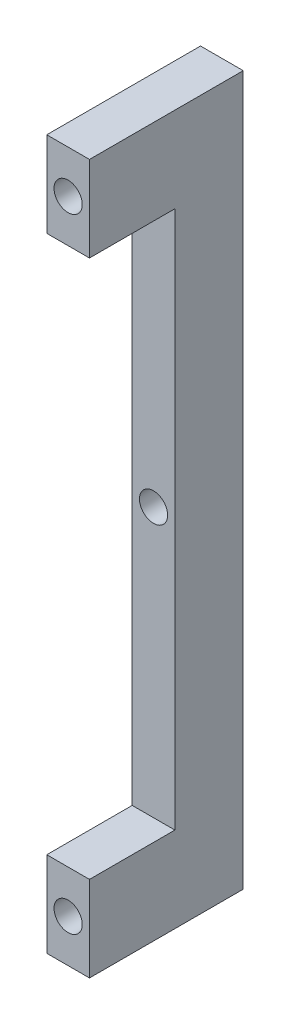
ISO-10303-21;
HEADER;
FILE_DESCRIPTION(('STEP AP214'),'2;1');
FILE_NAME('part.step','',(''),(''),'','','');
FILE_SCHEMA(('AUTOMOTIVE_DESIGN { 1 0 10303 214 1 1 1 1 }'));
ENDSEC;
DATA;
#1=APPLICATION_CONTEXT('core data for automotive mechanical design processes');
#2=APPLICATION_PROTOCOL_DEFINITION('international standard','automotive_design',2000,#1);
#3=PRODUCT_CONTEXT('',#1,'mechanical');
#4=PRODUCT('Part','Part','',(#3));
#5=PRODUCT_RELATED_PRODUCT_CATEGORY('part','',(#4));
#6=PRODUCT_DEFINITION_FORMATION('','',#4);
#7=PRODUCT_DEFINITION_CONTEXT('part definition',#1,'design');
#8=PRODUCT_DEFINITION('design','',#6,#7);
#9=PRODUCT_DEFINITION_SHAPE('','',#8);
#10=(LENGTH_UNIT() NAMED_UNIT(*) SI_UNIT(.MILLI.,.METRE.));
#11=(NAMED_UNIT(*) PLANE_ANGLE_UNIT() SI_UNIT($,.RADIAN.));
#12=(NAMED_UNIT(*) SI_UNIT($,.STERADIAN.) SOLID_ANGLE_UNIT());
#13=UNCERTAINTY_MEASURE_WITH_UNIT(LENGTH_MEASURE(1.E-05),#10,'distance_accuracy_value','');
#14=(GEOMETRIC_REPRESENTATION_CONTEXT(3) GLOBAL_UNCERTAINTY_ASSIGNED_CONTEXT((#13)) GLOBAL_UNIT_ASSIGNED_CONTEXT((#10,
#11,#12)) REPRESENTATION_CONTEXT('',''));
#15=CARTESIAN_POINT('',(0.,0.,0.));
#16=DIRECTION('',(0.,0.,1.));
#17=DIRECTION('',(1.,0.,0.));
#18=AXIS2_PLACEMENT_3D('',#15,#16,#17);
#19=CARTESIAN_POINT('',(0.,0.,0.));
#20=DIRECTION('',(0.,0.,1.));
#21=DIRECTION('',(1.,0.,0.));
#22=AXIS2_PLACEMENT_3D('',#19,#20,#21);
#23=PLANE('',#22);
#24=DIRECTION('',(-1.,0.,0.));
#25=VECTOR('',#24,1.);
#26=CARTESIAN_POINT('',(-2.5,68.,0.));
#27=LINE('',#26,#25);
#28=CARTESIAN_POINT('',(2.50000000000001,68.,0.));
#29=VERTEX_POINT('',#28);
#30=CARTESIAN_POINT('',(-2.5,68.,0.));
#31=VERTEX_POINT('',#30);
#32=EDGE_CURVE('E139',#29,#31,#27,.T.);
#33=ORIENTED_EDGE('',*,*,#32,.F.);
#34=DIRECTION('',(0.,1.,0.));
#35=VECTOR('',#34,1.);
#36=CARTESIAN_POINT('',(2.5,78.,0.));
#37=LINE('',#36,#35);
#38=CARTESIAN_POINT('',(2.5,78.,0.));
#39=VERTEX_POINT('',#38);
#40=EDGE_CURVE('E180',#29,#39,#37,.T.);
#41=ORIENTED_EDGE('',*,*,#40,.T.);
#42=DIRECTION('',(-1.,0.,0.));
#43=VECTOR('',#42,1.);
#44=CARTESIAN_POINT('',(-2.5,78.,0.));
#45=LINE('',#44,#43);
#46=CARTESIAN_POINT('',(-2.5,78.,0.));
#47=VERTEX_POINT('',#46);
#48=EDGE_CURVE('E167',#39,#47,#45,.T.);
#49=ORIENTED_EDGE('',*,*,#48,.T.);
#50=DIRECTION('',(0.,-1.,0.));
#51=VECTOR('',#50,1.);
#52=CARTESIAN_POINT('',(-2.5,78.,0.));
#53=LINE('',#52,#51);
#54=EDGE_CURVE('E174',#47,#31,#53,.T.);
#55=ORIENTED_EDGE('',*,*,#54,.T.);
#56=EDGE_LOOP('',(#33,#41,#49,#55));
#57=FACE_BOUND('',#56,.T.);
#58=CARTESIAN_POINT('',(0.,73.,0.));
#59=DIRECTION('',(0.,0.,1.));
#60=DIRECTION('',(1.,0.,0.));
#61=AXIS2_PLACEMENT_3D('',#58,#59,#60);
#62=CIRCLE('',#61,1.65);
#63=CARTESIAN_POINT('',(1.65,73.,0.));
#64=VERTEX_POINT('',#63);
#65=EDGE_CURVE('E158',#64,#64,#62,.T.);
#66=ORIENTED_EDGE('',*,*,#65,.F.);
#67=EDGE_LOOP('',(#66));
#68=FACE_BOUND('',#67,.T.);
#69=ADVANCED_FACE('F49',(#57,#68),#23,.T.);
#70=CARTESIAN_POINT('',(0.,36.5,0.));
#71=DIRECTION('',(0.,0.,1.));
#72=DIRECTION('',(1.,0.,0.));
#73=AXIS2_PLACEMENT_3D('',#70,#71,#72);
#74=CYLINDRICAL_SURFACE('',#73,1.65);
#75=CARTESIAN_POINT('',(0.,36.5,-18.));
#76=DIRECTION('',(0.,0.,1.));
#77=DIRECTION('',(1.,0.,0.));
#78=AXIS2_PLACEMENT_3D('',#75,#76,#77);
#79=CIRCLE('',#78,1.65);
#80=CARTESIAN_POINT('',(1.65,36.5,-18.));
#81=VERTEX_POINT('',#80);
#82=EDGE_CURVE('E155',#81,#81,#79,.T.);
#83=ORIENTED_EDGE('',*,*,#82,.F.);
#84=EDGE_LOOP('',(#83));
#85=FACE_BOUND('',#84,.T.);
#86=CARTESIAN_POINT('',(0.,36.5,-10.));
#87=DIRECTION('',(0.,0.,1.));
#88=DIRECTION('',(1.,0.,0.));
#89=AXIS2_PLACEMENT_3D('',#86,#87,#88);
#90=CIRCLE('',#89,1.65);
#91=CARTESIAN_POINT('',(1.65,36.5,-10.));
#92=VERTEX_POINT('',#91);
#93=EDGE_CURVE('E53',#92,#92,#90,.F.);
#94=ORIENTED_EDGE('',*,*,#93,.F.);
#95=EDGE_LOOP('',(#94));
#96=FACE_BOUND('',#95,.T.);
#97=ADVANCED_FACE('F219',(#85,#96),#74,.F.);
#98=CARTESIAN_POINT('',(-2.5,78.,-18.));
#99=DIRECTION('',(-1.,0.,0.));
#100=DIRECTION('',(0.,-1.,0.));
#101=AXIS2_PLACEMENT_3D('',#98,#99,#100);
#102=PLANE('',#101);
#103=DIRECTION('',(0.,0.,1.));
#104=VECTOR('',#103,1.);
#105=CARTESIAN_POINT('',(-2.5,68.,-10.));
#106=LINE('',#105,#104);
#107=CARTESIAN_POINT('',(-2.5,68.,-10.));
#108=VERTEX_POINT('',#107);
#109=EDGE_CURVE('E199',#108,#31,#106,.T.);
#110=ORIENTED_EDGE('',*,*,#109,.T.);
#111=ORIENTED_EDGE('',*,*,#54,.F.);
#112=DIRECTION('',(0.,0.,1.));
#113=VECTOR('',#112,1.);
#114=CARTESIAN_POINT('',(-2.5,78.,-18.));
#115=LINE('',#114,#113);
#116=CARTESIAN_POINT('',(-2.5,78.,-18.));
#117=VERTEX_POINT('',#116);
#118=EDGE_CURVE('E13',#117,#47,#115,.T.);
#119=ORIENTED_EDGE('',*,*,#118,.F.);
#120=DIRECTION('',(0.,-1.,0.));
#121=VECTOR('',#120,1.);
#122=CARTESIAN_POINT('',(-2.5,78.,-18.));
#123=LINE('',#122,#121);
#124=CARTESIAN_POINT('',(-2.49999999999999,-5.,-18.));
#125=VERTEX_POINT('',#124);
#126=EDGE_CURVE('E164',#117,#125,#123,.T.);
#127=ORIENTED_EDGE('',*,*,#126,.T.);
#128=DIRECTION('',(0.,0.,1.));
#129=VECTOR('',#128,1.);
#130=CARTESIAN_POINT('',(-2.49999999999999,-5.,-18.));
#131=LINE('',#130,#129);
#132=CARTESIAN_POINT('',(-2.49999999999999,-5.,0.));
#133=VERTEX_POINT('',#132);
#134=EDGE_CURVE('E100',#125,#133,#131,.T.);
#135=ORIENTED_EDGE('',*,*,#134,.T.);
#136=CARTESIAN_POINT('',(-2.49999999999999,5.00000000000003,0.));
#137=VERTEX_POINT('',#136);
#138=EDGE_CURVE('E142',#137,#133,#53,.T.);
#139=ORIENTED_EDGE('',*,*,#138,.F.);
#140=DIRECTION('',(0.,0.,1.));
#141=VECTOR('',#140,1.);
#142=CARTESIAN_POINT('',(-2.5,5.,-10.));
#143=LINE('',#142,#141);
#144=CARTESIAN_POINT('',(-2.5,5.,-10.));
#145=VERTEX_POINT('',#144);
#146=EDGE_CURVE('E66',#145,#137,#143,.T.);
#147=ORIENTED_EDGE('',*,*,#146,.F.);
#148=DIRECTION('',(0.,-1.,0.));
#149=VECTOR('',#148,1.);
#150=CARTESIAN_POINT('',(-2.5,68.,-10.));
#151=LINE('',#150,#149);
#152=EDGE_CURVE('E130',#108,#145,#151,.T.);
#153=ORIENTED_EDGE('',*,*,#152,.F.);
#154=EDGE_LOOP('',(#110,#111,#119,#127,#135,#139,#147,#153));
#155=FACE_BOUND('',#154,.T.);
#156=ADVANCED_FACE('F51',(#155),#102,.T.);
#157=CARTESIAN_POINT('',(-2.5,78.,-18.));
#158=DIRECTION('',(0.,1.,0.));
#159=DIRECTION('',(0.,0.,1.));
#160=AXIS2_PLACEMENT_3D('',#157,#158,#159);
#161=PLANE('',#160);
#162=ORIENTED_EDGE('',*,*,#48,.F.);
#163=DIRECTION('',(0.,0.,1.));
#164=VECTOR('',#163,1.);
#165=CARTESIAN_POINT('',(2.5,78.,-18.));
#166=LINE('',#165,#164);
#167=CARTESIAN_POINT('',(2.5,78.,-18.));
#168=VERTEX_POINT('',#167);
#169=EDGE_CURVE('E58',#168,#39,#166,.T.);
#170=ORIENTED_EDGE('',*,*,#169,.F.);
#171=DIRECTION('',(-1.,0.,0.));
#172=VECTOR('',#171,1.);
#173=CARTESIAN_POINT('',(-2.5,78.,-18.));
#174=LINE('',#173,#172);
#175=EDGE_CURVE('E172',#168,#117,#174,.T.);
#176=ORIENTED_EDGE('',*,*,#175,.T.);
#177=ORIENTED_EDGE('',*,*,#118,.T.);
#178=EDGE_LOOP('',(#162,#170,#176,#177));
#179=FACE_BOUND('',#178,.T.);
#180=ADVANCED_FACE('F211',(#179),#161,.T.);
#181=CARTESIAN_POINT('',(2.5,78.,-18.));
#182=DIRECTION('',(1.,0.,0.));
#183=DIRECTION('',(0.,1.,0.));
#184=AXIS2_PLACEMENT_3D('',#181,#182,#183);
#185=PLANE('',#184);
#186=DIRECTION('',(0.,0.,1.));
#187=VECTOR('',#186,1.);
#188=CARTESIAN_POINT('',(2.50000000000001,68.,-10.));
#189=LINE('',#188,#187);
#190=CARTESIAN_POINT('',(2.50000000000001,68.,-10.));
#191=VERTEX_POINT('',#190);
#192=EDGE_CURVE('E144',#191,#29,#189,.T.);
#193=ORIENTED_EDGE('',*,*,#192,.F.);
#194=DIRECTION('',(0.,1.,0.));
#195=VECTOR('',#194,1.);
#196=CARTESIAN_POINT('',(2.50000000000001,68.,-10.));
#197=LINE('',#196,#195);
#198=CARTESIAN_POINT('',(2.50000000000001,5.,-10.));
#199=VERTEX_POINT('',#198);
#200=EDGE_CURVE('E129',#199,#191,#197,.T.);
#201=ORIENTED_EDGE('',*,*,#200,.F.);
#202=DIRECTION('',(0.,0.,1.));
#203=VECTOR('',#202,1.);
#204=CARTESIAN_POINT('',(2.50000000000001,5.,-10.));
#205=LINE('',#204,#203);
#206=CARTESIAN_POINT('',(2.50000000000001,5.,0.));
#207=VERTEX_POINT('',#206);
#208=EDGE_CURVE('E126',#199,#207,#205,.T.);
#209=ORIENTED_EDGE('',*,*,#208,.T.);
#210=CARTESIAN_POINT('',(2.50000000000001,-5.,0.));
#211=VERTEX_POINT('',#210);
#212=EDGE_CURVE('E181',#211,#207,#37,.T.);
#213=ORIENTED_EDGE('',*,*,#212,.F.);
#214=DIRECTION('',(0.,0.,1.));
#215=VECTOR('',#214,1.);
#216=CARTESIAN_POINT('',(2.50000000000001,-5.,-18.));
#217=LINE('',#216,#215);
#218=CARTESIAN_POINT('',(2.50000000000001,-5.,-18.));
#219=VERTEX_POINT('',#218);
#220=EDGE_CURVE('E188',#219,#211,#217,.T.);
#221=ORIENTED_EDGE('',*,*,#220,.F.);
#222=DIRECTION('',(0.,1.,0.));
#223=VECTOR('',#222,1.);
#224=CARTESIAN_POINT('',(2.5,78.,-18.));
#225=LINE('',#224,#223);
#226=EDGE_CURVE('E169',#219,#168,#225,.T.);
#227=ORIENTED_EDGE('',*,*,#226,.T.);
#228=ORIENTED_EDGE('',*,*,#169,.T.);
#229=ORIENTED_EDGE('',*,*,#40,.F.);
#230=EDGE_LOOP('',(#193,#201,#209,#213,#221,#227,#228,#229));
#231=FACE_BOUND('',#230,.T.);
#232=ADVANCED_FACE('F208',(#231),#185,.T.);
#233=CARTESIAN_POINT('',(-2.49999999999999,-5.,-18.));
#234=DIRECTION('',(0.,-1.,0.));
#235=DIRECTION('',(0.,0.,-1.));
#236=AXIS2_PLACEMENT_3D('',#233,#234,#235);
#237=PLANE('',#236);
#238=DIRECTION('',(1.,0.,0.));
#239=VECTOR('',#238,1.);
#240=CARTESIAN_POINT('',(-2.49999999999999,-5.,0.));
#241=LINE('',#240,#239);
#242=EDGE_CURVE('E177',#133,#211,#241,.T.);
#243=ORIENTED_EDGE('',*,*,#242,.F.);
#244=ORIENTED_EDGE('',*,*,#134,.F.);
#245=DIRECTION('',(1.,0.,0.));
#246=VECTOR('',#245,1.);
#247=CARTESIAN_POINT('',(-2.49999999999999,-5.,-18.));
#248=LINE('',#247,#246);
#249=EDGE_CURVE('E166',#125,#219,#248,.T.);
#250=ORIENTED_EDGE('',*,*,#249,.T.);
#251=ORIENTED_EDGE('',*,*,#220,.T.);
#252=EDGE_LOOP('',(#243,#244,#250,#251));
#253=FACE_BOUND('',#252,.T.);
#254=ADVANCED_FACE('F189',(#253),#237,.T.);
#255=CARTESIAN_POINT('',(0.,0.,-18.));
#256=DIRECTION('',(0.,0.,1.));
#257=DIRECTION('',(1.,0.,0.));
#258=AXIS2_PLACEMENT_3D('',#255,#256,#257);
#259=PLANE('',#258);
#260=CARTESIAN_POINT('',(0.,0.,-18.));
#261=DIRECTION('',(0.,0.,1.));
#262=DIRECTION('',(1.,0.,0.));
#263=AXIS2_PLACEMENT_3D('',#260,#261,#262);
#264=CIRCLE('',#263,1.65);
#265=CARTESIAN_POINT('',(1.65,0.,-18.));
#266=VERTEX_POINT('',#265);
#267=EDGE_CURVE('E152',#266,#266,#264,.T.);
#268=ORIENTED_EDGE('',*,*,#267,.T.);
#269=EDGE_LOOP('',(#268));
#270=FACE_BOUND('',#269,.T.);
#271=ORIENTED_EDGE('',*,*,#82,.T.);
#272=EDGE_LOOP('',(#271));
#273=FACE_BOUND('',#272,.T.);
#274=CARTESIAN_POINT('',(0.,73.,-18.));
#275=DIRECTION('',(0.,0.,1.));
#276=DIRECTION('',(1.,0.,0.));
#277=AXIS2_PLACEMENT_3D('',#274,#275,#276);
#278=CIRCLE('',#277,1.65);
#279=CARTESIAN_POINT('',(1.65,73.,-18.));
#280=VERTEX_POINT('',#279);
#281=EDGE_CURVE('E161',#280,#280,#278,.T.);
#282=ORIENTED_EDGE('',*,*,#281,.T.);
#283=EDGE_LOOP('',(#282));
#284=FACE_BOUND('',#283,.T.);
#285=ORIENTED_EDGE('',*,*,#126,.F.);
#286=ORIENTED_EDGE('',*,*,#175,.F.);
#287=ORIENTED_EDGE('',*,*,#226,.F.);
#288=ORIENTED_EDGE('',*,*,#249,.F.);
#289=EDGE_LOOP('',(#285,#286,#287,#288));
#290=FACE_BOUND('',#289,.T.);
#291=ADVANCED_FACE('F230',(#270,#273,#284,#290),#259,.F.);
#292=DIRECTION('',(1.,0.,0.));
#293=VECTOR('',#292,1.);
#294=CARTESIAN_POINT('',(-2.5,5.,0.));
#295=LINE('',#294,#293);
#296=EDGE_CURVE('E194',#137,#207,#295,.T.);
#297=ORIENTED_EDGE('',*,*,#296,.F.);
#298=ORIENTED_EDGE('',*,*,#138,.T.);
#299=ORIENTED_EDGE('',*,*,#242,.T.);
#300=ORIENTED_EDGE('',*,*,#212,.T.);
#301=EDGE_LOOP('',(#297,#298,#299,#300));
#302=FACE_BOUND('',#301,.T.);
#303=CARTESIAN_POINT('',(0.,0.,0.));
#304=DIRECTION('',(0.,0.,1.));
#305=DIRECTION('',(1.,0.,0.));
#306=AXIS2_PLACEMENT_3D('',#303,#304,#305);
#307=CIRCLE('',#306,1.65);
#308=CARTESIAN_POINT('',(1.65,0.,0.));
#309=VERTEX_POINT('',#308);
#310=EDGE_CURVE('E149',#309,#309,#307,.T.);
#311=ORIENTED_EDGE('',*,*,#310,.F.);
#312=EDGE_LOOP('',(#311));
#313=FACE_BOUND('',#312,.T.);
#314=ADVANCED_FACE('F192',(#302,#313),#23,.T.);
#315=CARTESIAN_POINT('',(0.,73.,0.));
#316=DIRECTION('',(0.,0.,1.));
#317=DIRECTION('',(1.,0.,0.));
#318=AXIS2_PLACEMENT_3D('',#315,#316,#317);
#319=CYLINDRICAL_SURFACE('',#318,1.65);
#320=ORIENTED_EDGE('',*,*,#281,.F.);
#321=EDGE_LOOP('',(#320));
#322=FACE_BOUND('',#321,.T.);
#323=ORIENTED_EDGE('',*,*,#65,.T.);
#324=EDGE_LOOP('',(#323));
#325=FACE_BOUND('',#324,.T.);
#326=ADVANCED_FACE('F229',(#322,#325),#319,.F.);
#327=CARTESIAN_POINT('',(0.,0.,0.));
#328=DIRECTION('',(0.,0.,1.));
#329=DIRECTION('',(1.,0.,0.));
#330=AXIS2_PLACEMENT_3D('',#327,#328,#329);
#331=CYLINDRICAL_SURFACE('',#330,1.65);
#332=ORIENTED_EDGE('',*,*,#267,.F.);
#333=EDGE_LOOP('',(#332));
#334=FACE_BOUND('',#333,.T.);
#335=ORIENTED_EDGE('',*,*,#310,.T.);
#336=EDGE_LOOP('',(#335));
#337=FACE_BOUND('',#336,.T.);
#338=ADVANCED_FACE('F235',(#334,#337),#331,.F.);
#339=CARTESIAN_POINT('',(0.,0.,-10.));
#340=DIRECTION('',(0.,0.,1.));
#341=DIRECTION('',(1.,0.,0.));
#342=AXIS2_PLACEMENT_3D('',#339,#340,#341);
#343=PLANE('',#342);
#344=ORIENTED_EDGE('',*,*,#152,.T.);
#345=DIRECTION('',(1.,0.,0.));
#346=VECTOR('',#345,1.);
#347=CARTESIAN_POINT('',(-2.5,5.,-10.));
#348=LINE('',#347,#346);
#349=EDGE_CURVE('E122',#145,#199,#348,.T.);
#350=ORIENTED_EDGE('',*,*,#349,.T.);
#351=ORIENTED_EDGE('',*,*,#200,.T.);
#352=DIRECTION('',(-1.,0.,0.));
#353=VECTOR('',#352,1.);
#354=CARTESIAN_POINT('',(-2.5,68.,-10.));
#355=LINE('',#354,#353);
#356=EDGE_CURVE('E137',#191,#108,#355,.T.);
#357=ORIENTED_EDGE('',*,*,#356,.T.);
#358=EDGE_LOOP('',(#344,#350,#351,#357));
#359=FACE_BOUND('',#358,.T.);
#360=ORIENTED_EDGE('',*,*,#93,.T.);
#361=EDGE_LOOP('',(#360));
#362=FACE_BOUND('',#361,.T.);
#363=ADVANCED_FACE('F134',(#359,#362),#343,.T.);
#364=CARTESIAN_POINT('',(-2.5,68.,-10.));
#365=DIRECTION('',(0.,1.,0.));
#366=DIRECTION('',(-1.,0.,0.));
#367=AXIS2_PLACEMENT_3D('',#364,#365,#366);
#368=PLANE('',#367);
#369=ORIENTED_EDGE('',*,*,#32,.T.);
#370=ORIENTED_EDGE('',*,*,#109,.F.);
#371=ORIENTED_EDGE('',*,*,#356,.F.);
#372=ORIENTED_EDGE('',*,*,#192,.T.);
#373=EDGE_LOOP('',(#369,#370,#371,#372));
#374=FACE_BOUND('',#373,.T.);
#375=ADVANCED_FACE('F203',(#374),#368,.F.);
#376=CARTESIAN_POINT('',(-2.5,5.,-10.));
#377=DIRECTION('',(0.,-1.,0.));
#378=DIRECTION('',(1.,0.,0.));
#379=AXIS2_PLACEMENT_3D('',#376,#377,#378);
#380=PLANE('',#379);
#381=ORIENTED_EDGE('',*,*,#296,.T.);
#382=ORIENTED_EDGE('',*,*,#208,.F.);
#383=ORIENTED_EDGE('',*,*,#349,.F.);
#384=ORIENTED_EDGE('',*,*,#146,.T.);
#385=EDGE_LOOP('',(#381,#382,#383,#384));
#386=FACE_BOUND('',#385,.T.);
#387=ADVANCED_FACE('F124',(#386),#380,.F.);
#388=CLOSED_SHELL('',(#69,#97,#156,#180,#232,#254,#291,#314,#326,#338,#363,#375,#387));
#389=MANIFOLD_SOLID_BREP('B2',#388);
#390=ADVANCED_BREP_SHAPE_REPRESENTATION('',(#18,#389),#14);
#391=SHAPE_DEFINITION_REPRESENTATION(#9,#390);
ENDSEC;
END-ISO-10303-21;
